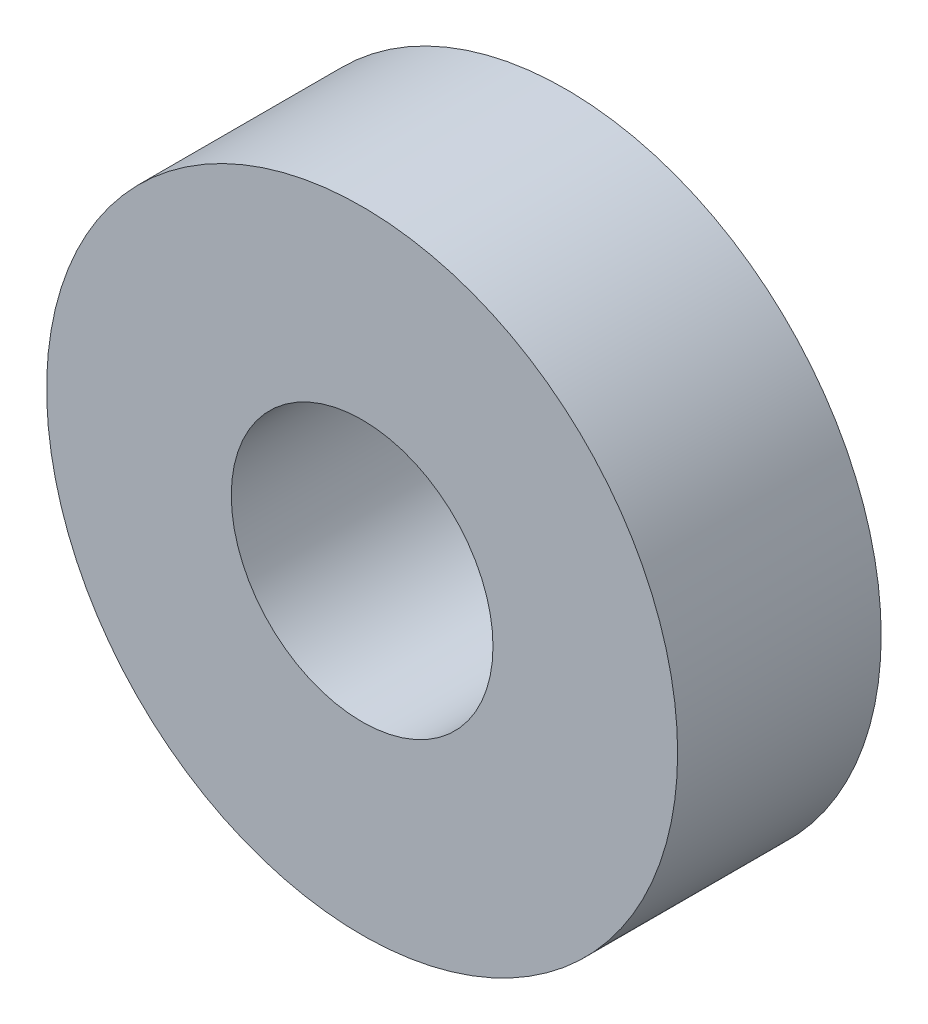
ISO-10303-21;
HEADER;
FILE_DESCRIPTION(('STEP AP214'),'2;1');
FILE_NAME('part.step','',(''),(''),'','','');
FILE_SCHEMA(('AUTOMOTIVE_DESIGN { 1 0 10303 214 1 1 1 1 }'));
ENDSEC;
DATA;
#1=APPLICATION_CONTEXT('core data for automotive mechanical design processes');
#2=APPLICATION_PROTOCOL_DEFINITION('international standard','automotive_design',2000,#1);
#3=PRODUCT_CONTEXT('',#1,'mechanical');
#4=PRODUCT('Part','Part','',(#3));
#5=PRODUCT_RELATED_PRODUCT_CATEGORY('part','',(#4));
#6=PRODUCT_DEFINITION_FORMATION('','',#4);
#7=PRODUCT_DEFINITION_CONTEXT('part definition',#1,'design');
#8=PRODUCT_DEFINITION('design','',#6,#7);
#9=PRODUCT_DEFINITION_SHAPE('','',#8);
#10=(LENGTH_UNIT() NAMED_UNIT(*) SI_UNIT(.MILLI.,.METRE.));
#11=(NAMED_UNIT(*) PLANE_ANGLE_UNIT() SI_UNIT($,.RADIAN.));
#12=(NAMED_UNIT(*) SI_UNIT($,.STERADIAN.) SOLID_ANGLE_UNIT());
#13=UNCERTAINTY_MEASURE_WITH_UNIT(LENGTH_MEASURE(1.E-05),#10,'distance_accuracy_value','');
#14=(GEOMETRIC_REPRESENTATION_CONTEXT(3) GLOBAL_UNCERTAINTY_ASSIGNED_CONTEXT((#13)) GLOBAL_UNIT_ASSIGNED_CONTEXT((#10,
#11,#12)) REPRESENTATION_CONTEXT('',''));
#15=CARTESIAN_POINT('',(0.,0.,0.));
#16=DIRECTION('',(0.,0.,1.));
#17=DIRECTION('',(1.,0.,0.));
#18=AXIS2_PLACEMENT_3D('',#15,#16,#17);
#19=CARTESIAN_POINT('',(7.60000000000022,2.15074260103718E-13,-24.8924512674785));
#20=DIRECTION('',(0.,0.,-1.));
#21=DIRECTION('',(-1.,0.,0.));
#22=AXIS2_PLACEMENT_3D('',#19,#20,#21);
#23=CYLINDRICAL_SURFACE('',#22,1.75000000000017);
#24=CARTESIAN_POINT('',(7.60000000000022,2.15074260103718E-13,-31.8924512674785));
#25=DIRECTION('',(0.,0.,1.));
#26=DIRECTION('',(1.,0.,0.));
#27=AXIS2_PLACEMENT_3D('',#24,#25,#26);
#28=CIRCLE('',#27,1.75000000000017);
#29=CARTESIAN_POINT('',(9.35000000000038,2.15074260103718E-13,-31.8924512674785));
#30=VERTEX_POINT('',#29);
#31=EDGE_CURVE('E46',#30,#30,#28,.T.);
#32=ORIENTED_EDGE('',*,*,#31,.F.);
#33=EDGE_LOOP('',(#32));
#34=FACE_BOUND('',#33,.T.);
#35=CARTESIAN_POINT('',(7.60000000000022,2.15074260103718E-13,-27.8924512674785));
#36=DIRECTION('',(0.,0.,1.));
#37=DIRECTION('',(1.,0.,0.));
#38=AXIS2_PLACEMENT_3D('',#35,#36,#37);
#39=CIRCLE('',#38,1.75000000000017);
#40=CARTESIAN_POINT('',(9.35000000000038,2.15074260103718E-13,-27.8924512674785));
#41=VERTEX_POINT('',#40);
#42=EDGE_CURVE('E70',#41,#41,#39,.T.);
#43=ORIENTED_EDGE('',*,*,#42,.T.);
#44=EDGE_LOOP('',(#43));
#45=FACE_BOUND('',#44,.T.);
#46=ADVANCED_FACE('F31',(#34,#45),#23,.F.);
#47=CARTESIAN_POINT('',(4.30148520207437E-13,-7.6,-24.8924512674785));
#48=DIRECTION('',(0.,0.,-1.));
#49=DIRECTION('',(-1.,0.,0.));
#50=AXIS2_PLACEMENT_3D('',#47,#48,#49);
#51=CYLINDRICAL_SURFACE('',#50,1.75000000000046);
#52=CARTESIAN_POINT('',(4.30148520207437E-13,-7.6,-31.8924512674785));
#53=DIRECTION('',(0.,0.,1.));
#54=DIRECTION('',(1.,0.,0.));
#55=AXIS2_PLACEMENT_3D('',#52,#53,#54);
#56=CIRCLE('',#55,1.75000000000046);
#57=CARTESIAN_POINT('',(1.75000000000089,-7.6,-31.8924512674785));
#58=VERTEX_POINT('',#57);
#59=EDGE_CURVE('E58',#58,#58,#56,.T.);
#60=ORIENTED_EDGE('',*,*,#59,.F.);
#61=EDGE_LOOP('',(#60));
#62=FACE_BOUND('',#61,.T.);
#63=CARTESIAN_POINT('',(4.30148520207437E-13,-7.6,-27.8924512674785));
#64=DIRECTION('',(0.,0.,1.));
#65=DIRECTION('',(1.,0.,0.));
#66=AXIS2_PLACEMENT_3D('',#63,#64,#65);
#67=CIRCLE('',#66,1.75000000000046);
#68=CARTESIAN_POINT('',(1.75000000000089,-7.6,-27.8924512674785));
#69=VERTEX_POINT('',#68);
#70=EDGE_CURVE('E67',#69,#69,#67,.T.);
#71=ORIENTED_EDGE('',*,*,#70,.T.);
#72=EDGE_LOOP('',(#71));
#73=FACE_BOUND('',#72,.T.);
#74=ADVANCED_FACE('F86',(#62,#73),#51,.F.);
#75=CARTESIAN_POINT('',(-7.59999999999979,-2.1600499167107E-13,-24.8924512674785));
#76=DIRECTION('',(0.,0.,-1.));
#77=DIRECTION('',(-1.,0.,0.));
#78=AXIS2_PLACEMENT_3D('',#75,#76,#77);
#79=CYLINDRICAL_SURFACE('',#78,1.75000000000035);
#80=CARTESIAN_POINT('',(-7.59999999999979,-2.1600499167107E-13,-31.8924512674785));
#81=DIRECTION('',(0.,0.,1.));
#82=DIRECTION('',(1.,0.,0.));
#83=AXIS2_PLACEMENT_3D('',#80,#81,#82);
#84=CIRCLE('',#83,1.75000000000035);
#85=CARTESIAN_POINT('',(-5.84999999999944,-2.1600499167107E-13,-31.8924512674785));
#86=VERTEX_POINT('',#85);
#87=EDGE_CURVE('E42',#86,#86,#84,.T.);
#88=ORIENTED_EDGE('',*,*,#87,.F.);
#89=EDGE_LOOP('',(#88));
#90=FACE_BOUND('',#89,.T.);
#91=CARTESIAN_POINT('',(-7.59999999999979,-2.1600499167107E-13,-27.8924512674785));
#92=DIRECTION('',(0.,0.,1.));
#93=DIRECTION('',(1.,0.,0.));
#94=AXIS2_PLACEMENT_3D('',#91,#92,#93);
#95=CIRCLE('',#94,1.75000000000034);
#96=CARTESIAN_POINT('',(-5.84999999999944,-2.1600499167107E-13,-27.8924512674785));
#97=VERTEX_POINT('',#96);
#98=EDGE_CURVE('E64',#97,#97,#95,.T.);
#99=ORIENTED_EDGE('',*,*,#98,.T.);
#100=EDGE_LOOP('',(#99));
#101=FACE_BOUND('',#100,.T.);
#102=ADVANCED_FACE('F92',(#90,#101),#79,.F.);
#103=CARTESIAN_POINT('',(0.,7.6,-24.8924512674785));
#104=DIRECTION('',(0.,0.,-1.));
#105=DIRECTION('',(-1.,0.,0.));
#106=AXIS2_PLACEMENT_3D('',#103,#104,#105);
#107=CYLINDRICAL_SURFACE('',#106,1.75);
#108=CARTESIAN_POINT('',(0.,7.6,-31.8924512674785));
#109=DIRECTION('',(0.,0.,1.));
#110=DIRECTION('',(1.,0.,0.));
#111=AXIS2_PLACEMENT_3D('',#108,#109,#110);
#112=CIRCLE('',#111,1.75);
#113=CARTESIAN_POINT('',(1.75,7.6,-31.8924512674785));
#114=VERTEX_POINT('',#113);
#115=EDGE_CURVE('E53',#114,#114,#112,.T.);
#116=ORIENTED_EDGE('',*,*,#115,.F.);
#117=EDGE_LOOP('',(#116));
#118=FACE_BOUND('',#117,.T.);
#119=CARTESIAN_POINT('',(0.,7.6,-27.8924512674785));
#120=DIRECTION('',(0.,0.,1.));
#121=DIRECTION('',(1.,0.,0.));
#122=AXIS2_PLACEMENT_3D('',#119,#120,#121);
#123=CIRCLE('',#122,1.75);
#124=CARTESIAN_POINT('',(1.75,7.6,-27.8924512674785));
#125=VERTEX_POINT('',#124);
#126=EDGE_CURVE('E61',#125,#125,#123,.T.);
#127=ORIENTED_EDGE('',*,*,#126,.T.);
#128=EDGE_LOOP('',(#127));
#129=FACE_BOUND('',#128,.T.);
#130=ADVANCED_FACE('F102',(#118,#129),#107,.F.);
#131=CARTESIAN_POINT('',(0.,0.,-24.8924512674785));
#132=DIRECTION('',(0.,0.,1.));
#133=DIRECTION('',(1.,0.,0.));
#134=AXIS2_PLACEMENT_3D('',#131,#132,#133);
#135=PLANE('',#134);
#136=CARTESIAN_POINT('',(0.,0.,-24.8924512674785));
#137=DIRECTION('',(0.,0.,1.));
#138=DIRECTION('',(1.,0.,0.));
#139=AXIS2_PLACEMENT_3D('',#136,#137,#138);
#140=CIRCLE('',#139,10.85);
#141=CARTESIAN_POINT('',(10.85,0.,-24.8924512674785));
#142=VERTEX_POINT('',#141);
#143=EDGE_CURVE('E10',#142,#142,#140,.T.);
#144=ORIENTED_EDGE('',*,*,#143,.T.);
#145=EDGE_LOOP('',(#144));
#146=FACE_BOUND('',#145,.T.);
#147=CARTESIAN_POINT('',(0.,0.,-24.8924512674785));
#148=DIRECTION('',(0.,0.,1.));
#149=DIRECTION('',(1.,0.,0.));
#150=AXIS2_PLACEMENT_3D('',#147,#148,#149);
#151=CIRCLE('',#150,4.5);
#152=CARTESIAN_POINT('',(4.5,0.,-24.8924512674785));
#153=VERTEX_POINT('',#152);
#154=EDGE_CURVE('E49',#153,#153,#151,.T.);
#155=ORIENTED_EDGE('',*,*,#154,.F.);
#156=EDGE_LOOP('',(#155));
#157=FACE_BOUND('',#156,.T.);
#158=ADVANCED_FACE('F104',(#146,#157),#135,.T.);
#159=CARTESIAN_POINT('',(0.,0.,-31.8924512674785));
#160=DIRECTION('',(0.,0.,1.));
#161=DIRECTION('',(1.,0.,0.));
#162=AXIS2_PLACEMENT_3D('',#159,#160,#161);
#163=PLANE('',#162);
#164=CARTESIAN_POINT('',(0.,0.,-31.8924512674785));
#165=DIRECTION('',(0.,0.,1.));
#166=DIRECTION('',(1.,0.,0.));
#167=AXIS2_PLACEMENT_3D('',#164,#165,#166);
#168=CIRCLE('',#167,10.85);
#169=CARTESIAN_POINT('',(10.85,0.,-31.8924512674785));
#170=VERTEX_POINT('',#169);
#171=EDGE_CURVE('E35',#170,#170,#168,.T.);
#172=ORIENTED_EDGE('',*,*,#171,.F.);
#173=EDGE_LOOP('',(#172));
#174=FACE_BOUND('',#173,.T.);
#175=ORIENTED_EDGE('',*,*,#87,.T.);
#176=EDGE_LOOP('',(#175));
#177=FACE_BOUND('',#176,.T.);
#178=ORIENTED_EDGE('',*,*,#31,.T.);
#179=EDGE_LOOP('',(#178));
#180=FACE_BOUND('',#179,.T.);
#181=CARTESIAN_POINT('',(0.,0.,-31.8924512674785));
#182=DIRECTION('',(0.,0.,1.));
#183=DIRECTION('',(1.,0.,0.));
#184=AXIS2_PLACEMENT_3D('',#181,#182,#183);
#185=CIRCLE('',#184,4.5);
#186=CARTESIAN_POINT('',(4.5,0.,-31.8924512674785));
#187=VERTEX_POINT('',#186);
#188=EDGE_CURVE('E50',#187,#187,#185,.T.);
#189=ORIENTED_EDGE('',*,*,#188,.T.);
#190=EDGE_LOOP('',(#189));
#191=FACE_BOUND('',#190,.T.);
#192=ORIENTED_EDGE('',*,*,#115,.T.);
#193=EDGE_LOOP('',(#192));
#194=FACE_BOUND('',#193,.T.);
#195=ORIENTED_EDGE('',*,*,#59,.T.);
#196=EDGE_LOOP('',(#195));
#197=FACE_BOUND('',#196,.T.);
#198=ADVANCED_FACE('F106',(#174,#177,#180,#191,#194,#197),#163,.F.);
#199=CARTESIAN_POINT('',(0.,0.,-24.8924512674785));
#200=DIRECTION('',(0.,0.,-1.));
#201=DIRECTION('',(-1.,0.,0.));
#202=AXIS2_PLACEMENT_3D('',#199,#200,#201);
#203=CYLINDRICAL_SURFACE('',#202,10.85);
#204=ORIENTED_EDGE('',*,*,#143,.F.);
#205=EDGE_LOOP('',(#204));
#206=FACE_BOUND('',#205,.T.);
#207=ORIENTED_EDGE('',*,*,#171,.T.);
#208=EDGE_LOOP('',(#207));
#209=FACE_BOUND('',#208,.T.);
#210=ADVANCED_FACE('F33',(#206,#209),#203,.T.);
#211=CARTESIAN_POINT('',(0.,0.,-24.8924512674785));
#212=DIRECTION('',(0.,0.,-1.));
#213=DIRECTION('',(-1.,0.,0.));
#214=AXIS2_PLACEMENT_3D('',#211,#212,#213);
#215=CYLINDRICAL_SURFACE('',#214,4.5);
#216=ORIENTED_EDGE('',*,*,#154,.T.);
#217=EDGE_LOOP('',(#216));
#218=FACE_BOUND('',#217,.T.);
#219=ORIENTED_EDGE('',*,*,#188,.F.);
#220=EDGE_LOOP('',(#219));
#221=FACE_BOUND('',#220,.T.);
#222=ADVANCED_FACE('F98',(#218,#221),#215,.F.);
#223=CARTESIAN_POINT('',(0.,7.6,-27.8924512674785));
#224=DIRECTION('',(0.,0.,1.));
#225=DIRECTION('',(1.,0.,0.));
#226=AXIS2_PLACEMENT_3D('',#223,#224,#225);
#227=PLANE('',#226);
#228=ORIENTED_EDGE('',*,*,#126,.F.);
#229=EDGE_LOOP('',(#228));
#230=FACE_BOUND('',#229,.T.);
#231=ADVANCED_FACE('F130',(#230),#227,.F.);
#232=CARTESIAN_POINT('',(-7.59999999999979,-2.1600499167107E-13,-27.8924512674785));
#233=DIRECTION('',(0.,0.,1.));
#234=DIRECTION('',(1.,0.,0.));
#235=AXIS2_PLACEMENT_3D('',#232,#233,#234);
#236=PLANE('',#235);
#237=ORIENTED_EDGE('',*,*,#98,.F.);
#238=EDGE_LOOP('',(#237));
#239=FACE_BOUND('',#238,.T.);
#240=ADVANCED_FACE('F82',(#239),#236,.F.);
#241=CARTESIAN_POINT('',(4.30148520207437E-13,-7.6,-27.8924512674785));
#242=DIRECTION('',(0.,0.,1.));
#243=DIRECTION('',(1.,0.,0.));
#244=AXIS2_PLACEMENT_3D('',#241,#242,#243);
#245=PLANE('',#244);
#246=ORIENTED_EDGE('',*,*,#70,.F.);
#247=EDGE_LOOP('',(#246));
#248=FACE_BOUND('',#247,.T.);
#249=ADVANCED_FACE('F77',(#248),#245,.F.);
#250=CARTESIAN_POINT('',(7.60000000000022,2.15074260103718E-13,-27.8924512674785));
#251=DIRECTION('',(0.,0.,1.));
#252=DIRECTION('',(1.,0.,0.));
#253=AXIS2_PLACEMENT_3D('',#250,#251,#252);
#254=PLANE('',#253);
#255=ORIENTED_EDGE('',*,*,#42,.F.);
#256=EDGE_LOOP('',(#255));
#257=FACE_BOUND('',#256,.T.);
#258=ADVANCED_FACE('F75',(#257),#254,.F.);
#259=CLOSED_SHELL('',(#46,#74,#102,#130,#158,#198,#210,#222,#231,#240,#249,#258));
#260=MANIFOLD_SOLID_BREP('B2',#259);
#261=ADVANCED_BREP_SHAPE_REPRESENTATION('',(#18,#260),#14);
#262=SHAPE_DEFINITION_REPRESENTATION(#9,#261);
ENDSEC;
END-ISO-10303-21;
